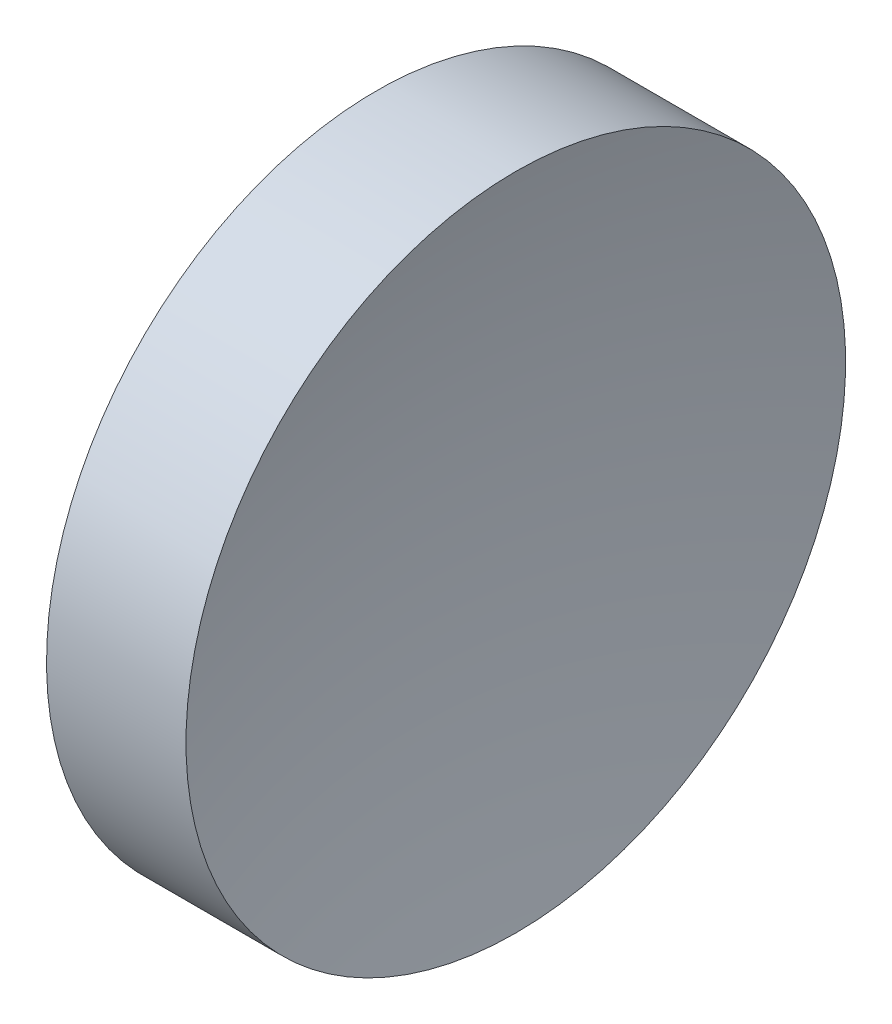
ISO-10303-21;
HEADER;
FILE_DESCRIPTION(('STEP AP214'),'2;1');
FILE_NAME('part.step','',(''),(''),'','','');
FILE_SCHEMA(('AUTOMOTIVE_DESIGN { 1 0 10303 214 1 1 1 1 }'));
ENDSEC;
DATA;
#1=APPLICATION_CONTEXT('core data for automotive mechanical design processes');
#2=APPLICATION_PROTOCOL_DEFINITION('international standard','automotive_design',2000,#1);
#3=PRODUCT_CONTEXT('',#1,'mechanical');
#4=PRODUCT('Part','Part','',(#3));
#5=PRODUCT_RELATED_PRODUCT_CATEGORY('part','',(#4));
#6=PRODUCT_DEFINITION_FORMATION('','',#4);
#7=PRODUCT_DEFINITION_CONTEXT('part definition',#1,'design');
#8=PRODUCT_DEFINITION('design','',#6,#7);
#9=PRODUCT_DEFINITION_SHAPE('','',#8);
#10=(LENGTH_UNIT() NAMED_UNIT(*) SI_UNIT(.MILLI.,.METRE.));
#11=(NAMED_UNIT(*) PLANE_ANGLE_UNIT() SI_UNIT($,.RADIAN.));
#12=(NAMED_UNIT(*) SI_UNIT($,.STERADIAN.) SOLID_ANGLE_UNIT());
#13=UNCERTAINTY_MEASURE_WITH_UNIT(LENGTH_MEASURE(1.E-05),#10,'distance_accuracy_value','');
#14=(GEOMETRIC_REPRESENTATION_CONTEXT(3) GLOBAL_UNCERTAINTY_ASSIGNED_CONTEXT((#13)) GLOBAL_UNIT_ASSIGNED_CONTEXT((#10,
#11,#12)) REPRESENTATION_CONTEXT('',''));
#15=CARTESIAN_POINT('',(0.,0.,0.));
#16=DIRECTION('',(0.,0.,1.));
#17=DIRECTION('',(1.,0.,0.));
#18=AXIS2_PLACEMENT_3D('',#15,#16,#17);
#19=CARTESIAN_POINT('',(44.5742320536207,13.031126091403,0.));
#20=DIRECTION('',(-1.,0.,0.));
#21=DIRECTION('',(0.,1.,0.));
#22=AXIS2_PLACEMENT_3D('',#19,#20,#21);
#23=SPHERICAL_SURFACE('',#22,20.65);
#24=CARTESIAN_POINT('',(24.538701114811,13.031126091403,0.));
#25=DIRECTION('',(-1.,0.,0.));
#26=DIRECTION('',(0.,-1.,0.));
#27=AXIS2_PLACEMENT_3D('',#24,#25,#26);
#28=CIRCLE('',#27,5.);
#29=CARTESIAN_POINT('',(24.538701114811,8.03112609140304,0.));
#30=VERTEX_POINT('',#29);
#31=EDGE_CURVE('E10',#30,#30,#28,.T.);
#32=ORIENTED_EDGE('',*,*,#31,.F.);
#33=EDGE_LOOP('',(#32));
#34=FACE_BOUND('',#33,.T.);
#35=ADVANCED_FACE('F33',(#34),#23,.F.);
#36=CARTESIAN_POINT('',(21.5059751180825,13.031126091403,0.));
#37=DIRECTION('',(-1.,0.,0.));
#38=DIRECTION('',(0.,-1.,0.));
#39=AXIS2_PLACEMENT_3D('',#36,#37,#38);
#40=CYLINDRICAL_SURFACE('',#39,5.);
#41=CARTESIAN_POINT('',(22.4242320536207,13.031126091403,0.));
#42=DIRECTION('',(-1.,0.,0.));
#43=DIRECTION('',(0.,-1.,0.));
#44=AXIS2_PLACEMENT_3D('',#41,#42,#43);
#45=CIRCLE('',#44,5.);
#46=CARTESIAN_POINT('',(22.4242320536207,8.03112609140304,0.));
#47=VERTEX_POINT('',#46);
#48=EDGE_CURVE('E39',#47,#47,#45,.T.);
#49=ORIENTED_EDGE('',*,*,#48,.F.);
#50=EDGE_LOOP('',(#49));
#51=FACE_BOUND('',#50,.T.);
#52=ORIENTED_EDGE('',*,*,#31,.T.);
#53=EDGE_LOOP('',(#52));
#54=FACE_BOUND('',#53,.T.);
#55=ADVANCED_FACE('F47',(#51,#54),#40,.T.);
#56=CARTESIAN_POINT('',(22.4242320536207,13.031126091403,0.));
#57=DIRECTION('',(1.,0.,0.));
#58=DIRECTION('',(0.,1.,0.));
#59=AXIS2_PLACEMENT_3D('',#56,#57,#58);
#60=PLANE('',#59);
#61=ORIENTED_EDGE('',*,*,#48,.T.);
#62=EDGE_LOOP('',(#61));
#63=FACE_BOUND('',#62,.T.);
#64=ADVANCED_FACE('F45',(#63),#60,.F.);
#65=CLOSED_SHELL('',(#35,#55,#64));
#66=MANIFOLD_SOLID_BREP('B2',#65);
#67=ADVANCED_BREP_SHAPE_REPRESENTATION('',(#18,#66),#14);
#68=SHAPE_DEFINITION_REPRESENTATION(#9,#67);
ENDSEC;
END-ISO-10303-21;
